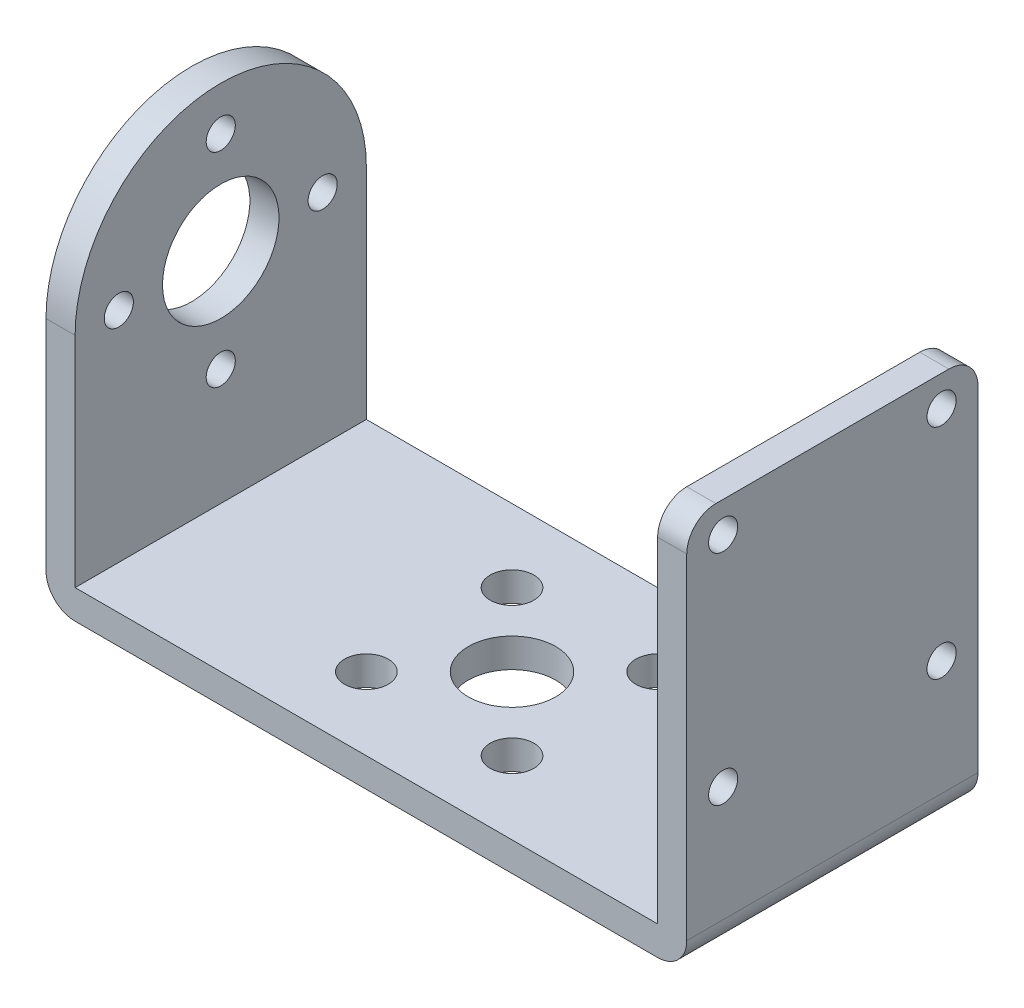
ISO-10303-21;
HEADER;
FILE_DESCRIPTION(('STEP AP214'),'2;1');
FILE_NAME('part.step','',(''),(''),'','','');
FILE_SCHEMA(('AUTOMOTIVE_DESIGN { 1 0 10303 214 1 1 1 1 }'));
ENDSEC;
DATA;
#1=APPLICATION_CONTEXT('core data for automotive mechanical design processes');
#2=APPLICATION_PROTOCOL_DEFINITION('international standard','automotive_design',2000,#1);
#3=PRODUCT_CONTEXT('',#1,'mechanical');
#4=PRODUCT('Part','Part','',(#3));
#5=PRODUCT_RELATED_PRODUCT_CATEGORY('part','',(#4));
#6=PRODUCT_DEFINITION_FORMATION('','',#4);
#7=PRODUCT_DEFINITION_CONTEXT('part definition',#1,'design');
#8=PRODUCT_DEFINITION('design','',#6,#7);
#9=PRODUCT_DEFINITION_SHAPE('','',#8);
#10=(LENGTH_UNIT() NAMED_UNIT(*) SI_UNIT(.MILLI.,.METRE.));
#11=(NAMED_UNIT(*) PLANE_ANGLE_UNIT() SI_UNIT($,.RADIAN.));
#12=(NAMED_UNIT(*) SI_UNIT($,.STERADIAN.) SOLID_ANGLE_UNIT());
#13=UNCERTAINTY_MEASURE_WITH_UNIT(LENGTH_MEASURE(1.E-05),#10,'distance_accuracy_value','');
#14=(GEOMETRIC_REPRESENTATION_CONTEXT(3) GLOBAL_UNCERTAINTY_ASSIGNED_CONTEXT((#13)) GLOBAL_UNIT_ASSIGNED_CONTEXT((#10,
#11,#12)) REPRESENTATION_CONTEXT('',''));
#15=CARTESIAN_POINT('',(0.,0.,0.));
#16=DIRECTION('',(0.,0.,1.));
#17=DIRECTION('',(1.,0.,0.));
#18=AXIS2_PLACEMENT_3D('',#15,#16,#17);
#19=CARTESIAN_POINT('',(21.,27.,0.));
#20=DIRECTION('',(0.,1.,0.));
#21=DIRECTION('',(0.,0.,1.));
#22=AXIS2_PLACEMENT_3D('',#19,#20,#21);
#23=PLANE('',#22);
#24=DIRECTION('',(0.,0.,-1.));
#25=VECTOR('',#24,1.);
#26=CARTESIAN_POINT('',(22.,27.,-10.));
#27=LINE('',#26,#25);
#28=CARTESIAN_POINT('',(22.,27.,-8.));
#29=VERTEX_POINT('',#28);
#30=CARTESIAN_POINT('',(22.,27.,8.));
#31=VERTEX_POINT('',#30);
#32=EDGE_CURVE('E100',#29,#31,#27,.F.);
#33=ORIENTED_EDGE('',*,*,#32,.F.);
#34=DIRECTION('',(1.,0.,0.));
#35=VECTOR('',#34,1.);
#36=CARTESIAN_POINT('',(-79.3584,27.,-8.));
#37=LINE('',#36,#35);
#38=CARTESIAN_POINT('',(20.,27.,-8.));
#39=VERTEX_POINT('',#38);
#40=EDGE_CURVE('E97',#39,#29,#37,.T.);
#41=ORIENTED_EDGE('',*,*,#40,.F.);
#42=DIRECTION('',(0.,0.,-1.));
#43=VECTOR('',#42,1.);
#44=CARTESIAN_POINT('',(20.,27.,-10.));
#45=LINE('',#44,#43);
#46=CARTESIAN_POINT('',(20.,27.,8.));
#47=VERTEX_POINT('',#46);
#48=EDGE_CURVE('E99',#39,#47,#45,.F.);
#49=ORIENTED_EDGE('',*,*,#48,.T.);
#50=DIRECTION('',(1.,0.,0.));
#51=VECTOR('',#50,1.);
#52=CARTESIAN_POINT('',(-79.3584,27.,8.));
#53=LINE('',#52,#51);
#54=EDGE_CURVE('E136',#31,#47,#53,.F.);
#55=ORIENTED_EDGE('',*,*,#54,.F.);
#56=EDGE_LOOP('',(#33,#41,#49,#55));
#57=FACE_BOUND('',#56,.T.);
#58=ADVANCED_FACE('F17',(#57),#23,.T.);
#59=CARTESIAN_POINT('',(-79.3584,25.,8.));
#60=DIRECTION('',(1.,0.,0.));
#61=DIRECTION('',(0.,0.,-1.));
#62=AXIS2_PLACEMENT_3D('',#59,#60,#61);
#63=CYLINDRICAL_SURFACE('',#62,2.);
#64=DIRECTION('',(1.,0.,0.));
#65=VECTOR('',#64,1.);
#66=CARTESIAN_POINT('',(21.,25.,10.));
#67=LINE('',#66,#65);
#68=CARTESIAN_POINT('',(22.,25.,10.));
#69=VERTEX_POINT('',#68);
#70=CARTESIAN_POINT('',(20.,25.,10.));
#71=VERTEX_POINT('',#70);
#72=EDGE_CURVE('E106',#69,#71,#67,.F.);
#73=ORIENTED_EDGE('',*,*,#72,.F.);
#74=CARTESIAN_POINT('',(22.,25.,8.));
#75=DIRECTION('',(1.,0.,0.));
#76=DIRECTION('',(0.,0.,-1.));
#77=AXIS2_PLACEMENT_3D('',#74,#75,#76);
#78=CIRCLE('',#77,2.);
#79=EDGE_CURVE('E239',#31,#69,#78,.T.);
#80=ORIENTED_EDGE('',*,*,#79,.F.);
#81=ORIENTED_EDGE('',*,*,#54,.T.);
#82=CARTESIAN_POINT('',(20.,25.,8.));
#83=DIRECTION('',(1.,0.,0.));
#84=DIRECTION('',(0.,0.,-1.));
#85=AXIS2_PLACEMENT_3D('',#82,#83,#84);
#86=CIRCLE('',#85,2.);
#87=EDGE_CURVE('E113',#47,#71,#86,.T.);
#88=ORIENTED_EDGE('',*,*,#87,.T.);
#89=EDGE_LOOP('',(#73,#80,#81,#88));
#90=FACE_BOUND('',#89,.T.);
#91=ADVANCED_FACE('F399',(#90),#63,.T.);
#92=CARTESIAN_POINT('',(-79.3584,25.,-8.));
#93=DIRECTION('',(1.,0.,0.));
#94=DIRECTION('',(0.,0.,-1.));
#95=AXIS2_PLACEMENT_3D('',#92,#93,#94);
#96=CYLINDRICAL_SURFACE('',#95,2.);
#97=ORIENTED_EDGE('',*,*,#40,.T.);
#98=CARTESIAN_POINT('',(22.,25.,-8.));
#99=DIRECTION('',(1.,0.,0.));
#100=DIRECTION('',(0.,0.,-1.));
#101=AXIS2_PLACEMENT_3D('',#98,#99,#100);
#102=CIRCLE('',#101,2.);
#103=CARTESIAN_POINT('',(22.,25.,-10.));
#104=VERTEX_POINT('',#103);
#105=EDGE_CURVE('E235',#104,#29,#102,.T.);
#106=ORIENTED_EDGE('',*,*,#105,.F.);
#107=DIRECTION('',(-1.,0.,0.));
#108=VECTOR('',#107,1.);
#109=CARTESIAN_POINT('',(21.,25.,-10.));
#110=LINE('',#109,#108);
#111=CARTESIAN_POINT('',(20.,25.,-10.));
#112=VERTEX_POINT('',#111);
#113=EDGE_CURVE('E105',#112,#104,#110,.F.);
#114=ORIENTED_EDGE('',*,*,#113,.F.);
#115=CARTESIAN_POINT('',(20.,25.,-8.));
#116=DIRECTION('',(1.,0.,0.));
#117=DIRECTION('',(0.,0.,-1.));
#118=AXIS2_PLACEMENT_3D('',#115,#116,#117);
#119=CIRCLE('',#118,2.);
#120=EDGE_CURVE('E20',#112,#39,#119,.T.);
#121=ORIENTED_EDGE('',*,*,#120,.T.);
#122=EDGE_LOOP('',(#97,#106,#114,#121));
#123=FACE_BOUND('',#122,.T.);
#124=ADVANCED_FACE('F116',(#123),#96,.T.);
#125=CARTESIAN_POINT('',(22.,24.89969380216,7.50060828213));
#126=DIRECTION('',(1.,0.,0.));
#127=DIRECTION('',(0.,0.,-1.));
#128=AXIS2_PLACEMENT_3D('',#125,#126,#127);
#129=CYLINDRICAL_SURFACE('',#128,1.);
#130=CARTESIAN_POINT('',(20.,24.89969380216,7.50060828213));
#131=DIRECTION('',(1.,0.,0.));
#132=DIRECTION('',(0.,0.,-1.));
#133=AXIS2_PLACEMENT_3D('',#130,#131,#132);
#134=CIRCLE('',#133,1.);
#135=CARTESIAN_POINT('',(20.,24.89969380216,6.50060828213));
#136=VERTEX_POINT('',#135);
#137=EDGE_CURVE('E280',#136,#136,#134,.F.);
#138=ORIENTED_EDGE('',*,*,#137,.T.);
#139=EDGE_LOOP('',(#138));
#140=FACE_BOUND('',#139,.T.);
#141=CARTESIAN_POINT('',(22.,24.89969380216,7.50060828213));
#142=DIRECTION('',(1.,0.,0.));
#143=DIRECTION('',(0.,0.,-1.));
#144=AXIS2_PLACEMENT_3D('',#141,#142,#143);
#145=CIRCLE('',#144,1.);
#146=CARTESIAN_POINT('',(22.,24.89969380216,6.50060828213));
#147=VERTEX_POINT('',#146);
#148=EDGE_CURVE('E231',#147,#147,#145,.F.);
#149=ORIENTED_EDGE('',*,*,#148,.F.);
#150=EDGE_LOOP('',(#149));
#151=FACE_BOUND('',#150,.T.);
#152=ADVANCED_FACE('F406',(#140,#151),#129,.F.);
#153=CARTESIAN_POINT('',(22.,24.90030617301,-7.49939170537));
#154=DIRECTION('',(1.,0.,0.));
#155=DIRECTION('',(0.,0.,-1.));
#156=AXIS2_PLACEMENT_3D('',#153,#154,#155);
#157=CYLINDRICAL_SURFACE('',#156,1.);
#158=CARTESIAN_POINT('',(20.,24.90030617301,-7.49939170537));
#159=DIRECTION('',(1.,0.,0.));
#160=DIRECTION('',(0.,0.,-1.));
#161=AXIS2_PLACEMENT_3D('',#158,#159,#160);
#162=CIRCLE('',#161,1.);
#163=CARTESIAN_POINT('',(20.,24.90030617301,-8.49939170537));
#164=VERTEX_POINT('',#163);
#165=EDGE_CURVE('E276',#164,#164,#162,.F.);
#166=ORIENTED_EDGE('',*,*,#165,.T.);
#167=EDGE_LOOP('',(#166));
#168=FACE_BOUND('',#167,.T.);
#169=CARTESIAN_POINT('',(22.,24.90030617301,-7.49939170537));
#170=DIRECTION('',(1.,0.,0.));
#171=DIRECTION('',(0.,0.,-1.));
#172=AXIS2_PLACEMENT_3D('',#169,#170,#171);
#173=CIRCLE('',#172,1.);
#174=CARTESIAN_POINT('',(22.,24.90030617301,-8.49939170537));
#175=VERTEX_POINT('',#174);
#176=EDGE_CURVE('E227',#175,#175,#173,.F.);
#177=ORIENTED_EDGE('',*,*,#176,.F.);
#178=EDGE_LOOP('',(#177));
#179=FACE_BOUND('',#178,.T.);
#180=ADVANCED_FACE('F489',(#168,#179),#157,.F.);
#181=CARTESIAN_POINT('',(22.,9.90030618551,-7.500004076222));
#182=DIRECTION('',(1.,0.,0.));
#183=DIRECTION('',(0.,0.,-1.));
#184=AXIS2_PLACEMENT_3D('',#181,#182,#183);
#185=CYLINDRICAL_SURFACE('',#184,1.);
#186=CARTESIAN_POINT('',(20.,9.90030618551,-7.500004076222));
#187=DIRECTION('',(1.,0.,0.));
#188=DIRECTION('',(0.,0.,-1.));
#189=AXIS2_PLACEMENT_3D('',#186,#187,#188);
#190=CIRCLE('',#189,1.);
#191=CARTESIAN_POINT('',(20.,9.90030618551,-8.500004076222));
#192=VERTEX_POINT('',#191);
#193=EDGE_CURVE('E272',#192,#192,#190,.F.);
#194=ORIENTED_EDGE('',*,*,#193,.T.);
#195=EDGE_LOOP('',(#194));
#196=FACE_BOUND('',#195,.T.);
#197=CARTESIAN_POINT('',(22.,9.90030618551,-7.500004076222));
#198=DIRECTION('',(1.,0.,0.));
#199=DIRECTION('',(0.,0.,-1.));
#200=AXIS2_PLACEMENT_3D('',#197,#198,#199);
#201=CIRCLE('',#200,1.);
#202=CARTESIAN_POINT('',(22.,9.90030618551,-8.500004076222));
#203=VERTEX_POINT('',#202);
#204=EDGE_CURVE('E223',#203,#203,#201,.F.);
#205=ORIENTED_EDGE('',*,*,#204,.F.);
#206=EDGE_LOOP('',(#205));
#207=FACE_BOUND('',#206,.T.);
#208=ADVANCED_FACE('F485',(#196,#207),#185,.F.);
#209=CARTESIAN_POINT('',(22.,9.899693814657,7.499995911278));
#210=DIRECTION('',(1.,0.,0.));
#211=DIRECTION('',(0.,0.,-1.));
#212=AXIS2_PLACEMENT_3D('',#209,#210,#211);
#213=CYLINDRICAL_SURFACE('',#212,1.);
#214=CARTESIAN_POINT('',(20.,9.899693814657,7.499995911278));
#215=DIRECTION('',(1.,0.,0.));
#216=DIRECTION('',(0.,0.,-1.));
#217=AXIS2_PLACEMENT_3D('',#214,#215,#216);
#218=CIRCLE('',#217,1.);
#219=CARTESIAN_POINT('',(20.,9.899693814657,6.499995911278));
#220=VERTEX_POINT('',#219);
#221=EDGE_CURVE('E268',#220,#220,#218,.F.);
#222=ORIENTED_EDGE('',*,*,#221,.T.);
#223=EDGE_LOOP('',(#222));
#224=FACE_BOUND('',#223,.T.);
#225=CARTESIAN_POINT('',(22.,9.899693814657,7.499995911278));
#226=DIRECTION('',(1.,0.,0.));
#227=DIRECTION('',(0.,0.,-1.));
#228=AXIS2_PLACEMENT_3D('',#225,#226,#227);
#229=CIRCLE('',#228,1.);
#230=CARTESIAN_POINT('',(22.,9.899693814657,6.499995911278));
#231=VERTEX_POINT('',#230);
#232=EDGE_CURVE('E218',#231,#231,#229,.F.);
#233=ORIENTED_EDGE('',*,*,#232,.F.);
#234=EDGE_LOOP('',(#233));
#235=FACE_BOUND('',#234,.T.);
#236=ADVANCED_FACE('F482',(#224,#235),#213,.F.);
#237=CARTESIAN_POINT('',(77.06874405191,17.,0.));
#238=DIRECTION('',(-1.,0.,0.));
#239=DIRECTION('',(0.,0.,1.));
#240=AXIS2_PLACEMENT_3D('',#237,#238,#239);
#241=CYLINDRICAL_SURFACE('',#240,10.);
#242=DIRECTION('',(-1.,0.,0.));
#243=VECTOR('',#242,1.);
#244=CARTESIAN_POINT('',(77.06874405191,17.,10.));
#245=LINE('',#244,#243);
#246=CARTESIAN_POINT('',(-22.,17.,10.));
#247=VERTEX_POINT('',#246);
#248=CARTESIAN_POINT('',(-20.,17.,10.));
#249=VERTEX_POINT('',#248);
#250=EDGE_CURVE('E119',#247,#249,#245,.F.);
#251=ORIENTED_EDGE('',*,*,#250,.T.);
#252=CARTESIAN_POINT('',(-20.,17.,0.));
#253=DIRECTION('',(-1.,0.,0.));
#254=DIRECTION('',(0.,0.,1.));
#255=AXIS2_PLACEMENT_3D('',#252,#253,#254);
#256=CIRCLE('',#255,10.);
#257=CARTESIAN_POINT('',(-20.,17.,-10.));
#258=VERTEX_POINT('',#257);
#259=EDGE_CURVE('E264',#249,#258,#256,.T.);
#260=ORIENTED_EDGE('',*,*,#259,.T.);
#261=DIRECTION('',(-1.,0.,0.));
#262=VECTOR('',#261,1.);
#263=CARTESIAN_POINT('',(77.06874405191,17.,-10.));
#264=LINE('',#263,#262);
#265=CARTESIAN_POINT('',(-22.,17.,-10.));
#266=VERTEX_POINT('',#265);
#267=EDGE_CURVE('E123',#258,#266,#264,.T.);
#268=ORIENTED_EDGE('',*,*,#267,.T.);
#269=CARTESIAN_POINT('',(-22.,17.,0.));
#270=DIRECTION('',(-1.,0.,0.));
#271=DIRECTION('',(0.,0.,1.));
#272=AXIS2_PLACEMENT_3D('',#269,#270,#271);
#273=CIRCLE('',#272,10.);
#274=EDGE_CURVE('E213',#247,#266,#273,.T.);
#275=ORIENTED_EDGE('',*,*,#274,.F.);
#276=EDGE_LOOP('',(#251,#260,#268,#275));
#277=FACE_BOUND('',#276,.T.);
#278=ADVANCED_FACE('F478',(#277),#241,.T.);
#279=CARTESIAN_POINT('',(-21.,17.,0.));
#280=DIRECTION('',(-1.,0.,0.));
#281=DIRECTION('',(0.,0.,1.));
#282=AXIS2_PLACEMENT_3D('',#279,#280,#281);
#283=CYLINDRICAL_SURFACE('',#282,4.);
#284=CARTESIAN_POINT('',(-20.,17.,0.));
#285=DIRECTION('',(-1.,0.,0.));
#286=DIRECTION('',(0.,0.,1.));
#287=AXIS2_PLACEMENT_3D('',#284,#285,#286);
#288=CIRCLE('',#287,4.);
#289=CARTESIAN_POINT('',(-20.,17.,4.));
#290=VERTEX_POINT('',#289);
#291=EDGE_CURVE('E243',#290,#290,#288,.F.);
#292=ORIENTED_EDGE('',*,*,#291,.T.);
#293=EDGE_LOOP('',(#292));
#294=FACE_BOUND('',#293,.T.);
#295=CARTESIAN_POINT('',(-22.,17.,0.));
#296=DIRECTION('',(-1.,0.,0.));
#297=DIRECTION('',(0.,0.,1.));
#298=AXIS2_PLACEMENT_3D('',#295,#296,#297);
#299=CIRCLE('',#298,4.);
#300=CARTESIAN_POINT('',(-22.,17.,4.));
#301=VERTEX_POINT('',#300);
#302=EDGE_CURVE('E209',#301,#301,#299,.F.);
#303=ORIENTED_EDGE('',*,*,#302,.F.);
#304=EDGE_LOOP('',(#303));
#305=FACE_BOUND('',#304,.T.);
#306=ADVANCED_FACE('F474',(#294,#305),#283,.F.);
#307=CARTESIAN_POINT('',(-21.,17.,7.));
#308=DIRECTION('',(-1.,0.,0.));
#309=DIRECTION('',(0.,0.,1.));
#310=AXIS2_PLACEMENT_3D('',#307,#308,#309);
#311=CYLINDRICAL_SURFACE('',#310,1.);
#312=CARTESIAN_POINT('',(-20.,17.,7.));
#313=DIRECTION('',(-1.,0.,0.));
#314=DIRECTION('',(0.,0.,1.));
#315=AXIS2_PLACEMENT_3D('',#312,#313,#314);
#316=CIRCLE('',#315,1.);
#317=CARTESIAN_POINT('',(-20.,17.,8.));
#318=VERTEX_POINT('',#317);
#319=EDGE_CURVE('E247',#318,#318,#316,.F.);
#320=ORIENTED_EDGE('',*,*,#319,.T.);
#321=EDGE_LOOP('',(#320));
#322=FACE_BOUND('',#321,.T.);
#323=CARTESIAN_POINT('',(-22.,17.,7.));
#324=DIRECTION('',(-1.,0.,0.));
#325=DIRECTION('',(0.,0.,1.));
#326=AXIS2_PLACEMENT_3D('',#323,#324,#325);
#327=CIRCLE('',#326,1.);
#328=CARTESIAN_POINT('',(-22.,17.,8.));
#329=VERTEX_POINT('',#328);
#330=EDGE_CURVE('E205',#329,#329,#327,.F.);
#331=ORIENTED_EDGE('',*,*,#330,.F.);
#332=EDGE_LOOP('',(#331));
#333=FACE_BOUND('',#332,.T.);
#334=ADVANCED_FACE('F470',(#322,#333),#311,.F.);
#335=CARTESIAN_POINT('',(-21.,17.,-7.));
#336=DIRECTION('',(-1.,0.,0.));
#337=DIRECTION('',(0.,0.,1.));
#338=AXIS2_PLACEMENT_3D('',#335,#336,#337);
#339=CYLINDRICAL_SURFACE('',#338,1.);
#340=CARTESIAN_POINT('',(-20.,17.,-7.));
#341=DIRECTION('',(-1.,0.,0.));
#342=DIRECTION('',(0.,0.,1.));
#343=AXIS2_PLACEMENT_3D('',#340,#341,#342);
#344=CIRCLE('',#343,1.);
#345=CARTESIAN_POINT('',(-20.,17.,-6.));
#346=VERTEX_POINT('',#345);
#347=EDGE_CURVE('E251',#346,#346,#344,.F.);
#348=ORIENTED_EDGE('',*,*,#347,.T.);
#349=EDGE_LOOP('',(#348));
#350=FACE_BOUND('',#349,.T.);
#351=CARTESIAN_POINT('',(-22.,17.,-7.));
#352=DIRECTION('',(-1.,0.,0.));
#353=DIRECTION('',(0.,0.,1.));
#354=AXIS2_PLACEMENT_3D('',#351,#352,#353);
#355=CIRCLE('',#354,1.);
#356=CARTESIAN_POINT('',(-22.,17.,-6.));
#357=VERTEX_POINT('',#356);
#358=EDGE_CURVE('E201',#357,#357,#355,.F.);
#359=ORIENTED_EDGE('',*,*,#358,.F.);
#360=EDGE_LOOP('',(#359));
#361=FACE_BOUND('',#360,.T.);
#362=ADVANCED_FACE('F466',(#350,#361),#339,.F.);
#363=CARTESIAN_POINT('',(-21.,24.,0.));
#364=DIRECTION('',(-1.,0.,0.));
#365=DIRECTION('',(0.,0.,1.));
#366=AXIS2_PLACEMENT_3D('',#363,#364,#365);
#367=CYLINDRICAL_SURFACE('',#366,1.);
#368=CARTESIAN_POINT('',(-20.,24.,0.));
#369=DIRECTION('',(-1.,0.,0.));
#370=DIRECTION('',(0.,0.,1.));
#371=AXIS2_PLACEMENT_3D('',#368,#369,#370);
#372=CIRCLE('',#371,1.);
#373=CARTESIAN_POINT('',(-20.,24.,1.));
#374=VERTEX_POINT('',#373);
#375=EDGE_CURVE('E255',#374,#374,#372,.F.);
#376=ORIENTED_EDGE('',*,*,#375,.T.);
#377=EDGE_LOOP('',(#376));
#378=FACE_BOUND('',#377,.T.);
#379=CARTESIAN_POINT('',(-22.,24.,0.));
#380=DIRECTION('',(-1.,0.,0.));
#381=DIRECTION('',(0.,0.,1.));
#382=AXIS2_PLACEMENT_3D('',#379,#380,#381);
#383=CIRCLE('',#382,1.);
#384=CARTESIAN_POINT('',(-22.,24.,1.));
#385=VERTEX_POINT('',#384);
#386=EDGE_CURVE('E197',#385,#385,#383,.F.);
#387=ORIENTED_EDGE('',*,*,#386,.F.);
#388=EDGE_LOOP('',(#387));
#389=FACE_BOUND('',#388,.T.);
#390=ADVANCED_FACE('F462',(#378,#389),#367,.F.);
#391=CARTESIAN_POINT('',(-21.,10.,0.));
#392=DIRECTION('',(-1.,0.,0.));
#393=DIRECTION('',(0.,0.,1.));
#394=AXIS2_PLACEMENT_3D('',#391,#392,#393);
#395=CYLINDRICAL_SURFACE('',#394,1.);
#396=CARTESIAN_POINT('',(-20.,10.,0.));
#397=DIRECTION('',(-1.,0.,0.));
#398=DIRECTION('',(0.,0.,1.));
#399=AXIS2_PLACEMENT_3D('',#396,#397,#398);
#400=CIRCLE('',#399,1.);
#401=CARTESIAN_POINT('',(-20.,10.,1.));
#402=VERTEX_POINT('',#401);
#403=EDGE_CURVE('E259',#402,#402,#400,.F.);
#404=ORIENTED_EDGE('',*,*,#403,.T.);
#405=EDGE_LOOP('',(#404));
#406=FACE_BOUND('',#405,.T.);
#407=CARTESIAN_POINT('',(-22.,10.,0.));
#408=DIRECTION('',(-1.,0.,0.));
#409=DIRECTION('',(0.,0.,1.));
#410=AXIS2_PLACEMENT_3D('',#407,#408,#409);
#411=CIRCLE('',#410,1.);
#412=CARTESIAN_POINT('',(-22.,10.,1.));
#413=VERTEX_POINT('',#412);
#414=EDGE_CURVE('E192',#413,#413,#411,.F.);
#415=ORIENTED_EDGE('',*,*,#414,.F.);
#416=EDGE_LOOP('',(#415));
#417=FACE_BOUND('',#416,.T.);
#418=ADVANCED_FACE('F458',(#406,#417),#395,.F.);
#419=CARTESIAN_POINT('',(20.,0.,-10.));
#420=DIRECTION('',(1.,0.,0.));
#421=DIRECTION('',(0.,0.,-1.));
#422=AXIS2_PLACEMENT_3D('',#419,#420,#421);
#423=PLANE('',#422);
#424=ORIENTED_EDGE('',*,*,#221,.F.);
#425=EDGE_LOOP('',(#424));
#426=FACE_BOUND('',#425,.T.);
#427=ORIENTED_EDGE('',*,*,#193,.F.);
#428=EDGE_LOOP('',(#427));
#429=FACE_BOUND('',#428,.T.);
#430=ORIENTED_EDGE('',*,*,#165,.F.);
#431=EDGE_LOOP('',(#430));
#432=FACE_BOUND('',#431,.T.);
#433=ORIENTED_EDGE('',*,*,#137,.F.);
#434=EDGE_LOOP('',(#433));
#435=FACE_BOUND('',#434,.T.);
#436=DIRECTION('',(0.,0.,1.));
#437=VECTOR('',#436,1.);
#438=CARTESIAN_POINT('',(20.,2.,0.));
#439=LINE('',#438,#437);
#440=CARTESIAN_POINT('',(20.,2.,10.));
#441=VERTEX_POINT('',#440);
#442=CARTESIAN_POINT('',(20.,2.,-10.));
#443=VERTEX_POINT('',#442);
#444=EDGE_CURVE('E196',#441,#443,#439,.F.);
#445=ORIENTED_EDGE('',*,*,#444,.F.);
#446=DIRECTION('',(0.,1.,0.));
#447=VECTOR('',#446,1.);
#448=CARTESIAN_POINT('',(20.,0.,10.));
#449=LINE('',#448,#447);
#450=EDGE_CURVE('E285',#71,#441,#449,.F.);
#451=ORIENTED_EDGE('',*,*,#450,.F.);
#452=ORIENTED_EDGE('',*,*,#87,.F.);
#453=ORIENTED_EDGE('',*,*,#48,.F.);
#454=ORIENTED_EDGE('',*,*,#120,.F.);
#455=DIRECTION('',(0.,1.,0.));
#456=VECTOR('',#455,1.);
#457=CARTESIAN_POINT('',(20.,0.,-10.));
#458=LINE('',#457,#456);
#459=EDGE_CURVE('E283',#443,#112,#458,.T.);
#460=ORIENTED_EDGE('',*,*,#459,.F.);
#461=EDGE_LOOP('',(#445,#451,#452,#453,#454,#460));
#462=FACE_BOUND('',#461,.T.);
#463=ADVANCED_FACE('F110',(#426,#429,#432,#435,#462),#423,.F.);
#464=CARTESIAN_POINT('',(-20.,0.,10.));
#465=DIRECTION('',(-1.,0.,0.));
#466=DIRECTION('',(0.,0.,1.));
#467=AXIS2_PLACEMENT_3D('',#464,#465,#466);
#468=PLANE('',#467);
#469=ORIENTED_EDGE('',*,*,#291,.F.);
#470=EDGE_LOOP('',(#469));
#471=FACE_BOUND('',#470,.T.);
#472=ORIENTED_EDGE('',*,*,#319,.F.);
#473=EDGE_LOOP('',(#472));
#474=FACE_BOUND('',#473,.T.);
#475=ORIENTED_EDGE('',*,*,#347,.F.);
#476=EDGE_LOOP('',(#475));
#477=FACE_BOUND('',#476,.T.);
#478=ORIENTED_EDGE('',*,*,#375,.F.);
#479=EDGE_LOOP('',(#478));
#480=FACE_BOUND('',#479,.T.);
#481=ORIENTED_EDGE('',*,*,#403,.F.);
#482=EDGE_LOOP('',(#481));
#483=FACE_BOUND('',#482,.T.);
#484=ORIENTED_EDGE('',*,*,#259,.F.);
#485=DIRECTION('',(0.,1.,0.));
#486=VECTOR('',#485,1.);
#487=CARTESIAN_POINT('',(-20.,0.,10.));
#488=LINE('',#487,#486);
#489=CARTESIAN_POINT('',(-20.,2.,10.));
#490=VERTEX_POINT('',#489);
#491=EDGE_CURVE('E267',#490,#249,#488,.T.);
#492=ORIENTED_EDGE('',*,*,#491,.F.);
#493=DIRECTION('',(0.,0.,1.));
#494=VECTOR('',#493,1.);
#495=CARTESIAN_POINT('',(-20.,2.,0.));
#496=LINE('',#495,#494);
#497=CARTESIAN_POINT('',(-20.,2.,-10.));
#498=VERTEX_POINT('',#497);
#499=EDGE_CURVE('E314',#498,#490,#496,.T.);
#500=ORIENTED_EDGE('',*,*,#499,.F.);
#501=DIRECTION('',(0.,1.,0.));
#502=VECTOR('',#501,1.);
#503=CARTESIAN_POINT('',(-20.,0.,-10.));
#504=LINE('',#503,#502);
#505=EDGE_CURVE('E263',#258,#498,#504,.F.);
#506=ORIENTED_EDGE('',*,*,#505,.F.);
#507=EDGE_LOOP('',(#484,#492,#500,#506));
#508=FACE_BOUND('',#507,.T.);
#509=ADVANCED_FACE('F371',(#471,#474,#477,#480,#483,#508),#468,.F.);
#510=CARTESIAN_POINT('',(22.,0.,-10.));
#511=DIRECTION('',(1.,0.,0.));
#512=DIRECTION('',(0.,0.,-1.));
#513=AXIS2_PLACEMENT_3D('',#510,#511,#512);
#514=PLANE('',#513);
#515=ORIENTED_EDGE('',*,*,#232,.T.);
#516=EDGE_LOOP('',(#515));
#517=FACE_BOUND('',#516,.T.);
#518=ORIENTED_EDGE('',*,*,#204,.T.);
#519=EDGE_LOOP('',(#518));
#520=FACE_BOUND('',#519,.T.);
#521=ORIENTED_EDGE('',*,*,#176,.T.);
#522=EDGE_LOOP('',(#521));
#523=FACE_BOUND('',#522,.T.);
#524=ORIENTED_EDGE('',*,*,#148,.T.);
#525=EDGE_LOOP('',(#524));
#526=FACE_BOUND('',#525,.T.);
#527=DIRECTION('',(0.,1.,0.));
#528=VECTOR('',#527,1.);
#529=CARTESIAN_POINT('',(22.,0.,-10.));
#530=LINE('',#529,#528);
#531=CARTESIAN_POINT('',(22.,2.,-10.));
#532=VERTEX_POINT('',#531);
#533=EDGE_CURVE('E238',#532,#104,#530,.T.);
#534=ORIENTED_EDGE('',*,*,#533,.T.);
#535=ORIENTED_EDGE('',*,*,#105,.T.);
#536=ORIENTED_EDGE('',*,*,#32,.T.);
#537=ORIENTED_EDGE('',*,*,#79,.T.);
#538=DIRECTION('',(0.,1.,0.));
#539=VECTOR('',#538,1.);
#540=CARTESIAN_POINT('',(22.,0.,10.));
#541=LINE('',#540,#539);
#542=CARTESIAN_POINT('',(22.,2.,10.));
#543=VERTEX_POINT('',#542);
#544=EDGE_CURVE('E242',#69,#543,#541,.F.);
#545=ORIENTED_EDGE('',*,*,#544,.T.);
#546=DIRECTION('',(0.,0.,-1.));
#547=VECTOR('',#546,1.);
#548=CARTESIAN_POINT('',(22.,2.,10.));
#549=LINE('',#548,#547);
#550=EDGE_CURVE('E187',#532,#543,#549,.F.);
#551=ORIENTED_EDGE('',*,*,#550,.F.);
#552=EDGE_LOOP('',(#534,#535,#536,#537,#545,#551));
#553=FACE_BOUND('',#552,.T.);
#554=ADVANCED_FACE('F397',(#517,#520,#523,#526,#553),#514,.T.);
#555=CARTESIAN_POINT('',(-22.,0.,10.));
#556=DIRECTION('',(-1.,0.,0.));
#557=DIRECTION('',(0.,0.,1.));
#558=AXIS2_PLACEMENT_3D('',#555,#556,#557);
#559=PLANE('',#558);
#560=ORIENTED_EDGE('',*,*,#414,.T.);
#561=EDGE_LOOP('',(#560));
#562=FACE_BOUND('',#561,.T.);
#563=ORIENTED_EDGE('',*,*,#386,.T.);
#564=EDGE_LOOP('',(#563));
#565=FACE_BOUND('',#564,.T.);
#566=ORIENTED_EDGE('',*,*,#358,.T.);
#567=EDGE_LOOP('',(#566));
#568=FACE_BOUND('',#567,.T.);
#569=ORIENTED_EDGE('',*,*,#330,.T.);
#570=EDGE_LOOP('',(#569));
#571=FACE_BOUND('',#570,.T.);
#572=ORIENTED_EDGE('',*,*,#302,.T.);
#573=EDGE_LOOP('',(#572));
#574=FACE_BOUND('',#573,.T.);
#575=DIRECTION('',(0.,1.,0.));
#576=VECTOR('',#575,1.);
#577=CARTESIAN_POINT('',(-22.,0.,10.));
#578=LINE('',#577,#576);
#579=CARTESIAN_POINT('',(-22.,2.,10.));
#580=VERTEX_POINT('',#579);
#581=EDGE_CURVE('E217',#580,#247,#578,.T.);
#582=ORIENTED_EDGE('',*,*,#581,.T.);
#583=ORIENTED_EDGE('',*,*,#274,.T.);
#584=DIRECTION('',(0.,1.,0.));
#585=VECTOR('',#584,1.);
#586=CARTESIAN_POINT('',(-22.,0.,-10.));
#587=LINE('',#586,#585);
#588=CARTESIAN_POINT('',(-22.,2.,-10.));
#589=VERTEX_POINT('',#588);
#590=EDGE_CURVE('E222',#266,#589,#587,.F.);
#591=ORIENTED_EDGE('',*,*,#590,.T.);
#592=DIRECTION('',(0.,0.,1.));
#593=VECTOR('',#592,1.);
#594=CARTESIAN_POINT('',(-22.,2.,-10.));
#595=LINE('',#594,#593);
#596=EDGE_CURVE('E176',#580,#589,#595,.F.);
#597=ORIENTED_EDGE('',*,*,#596,.F.);
#598=EDGE_LOOP('',(#582,#583,#591,#597));
#599=FACE_BOUND('',#598,.T.);
#600=ADVANCED_FACE('F363',(#562,#565,#568,#571,#574,#599),#559,.T.);
#601=CARTESIAN_POINT('',(0.,2.,0.));
#602=DIRECTION('',(0.,1.,0.));
#603=DIRECTION('',(0.,0.,1.));
#604=AXIS2_PLACEMENT_3D('',#601,#602,#603);
#605=PLANE('',#604);
#606=CARTESIAN_POINT('',(-5.,2.,-5.));
#607=DIRECTION('',(0.,-1.,0.));
#608=DIRECTION('',(0.,0.,-1.));
#609=AXIS2_PLACEMENT_3D('',#606,#607,#608);
#610=CIRCLE('',#609,1.5);
#611=CARTESIAN_POINT('',(-5.,2.,-6.5));
#612=VERTEX_POINT('',#611);
#613=EDGE_CURVE('E155',#612,#612,#610,.T.);
#614=ORIENTED_EDGE('',*,*,#613,.T.);
#615=EDGE_LOOP('',(#614));
#616=FACE_BOUND('',#615,.T.);
#617=CARTESIAN_POINT('',(0.,2.,0.));
#618=DIRECTION('',(0.,-1.,0.));
#619=DIRECTION('',(0.,0.,-1.));
#620=AXIS2_PLACEMENT_3D('',#617,#618,#619);
#621=CIRCLE('',#620,3.);
#622=CARTESIAN_POINT('',(0.,2.,-3.));
#623=VERTEX_POINT('',#622);
#624=EDGE_CURVE('E160',#623,#623,#621,.T.);
#625=ORIENTED_EDGE('',*,*,#624,.T.);
#626=EDGE_LOOP('',(#625));
#627=FACE_BOUND('',#626,.T.);
#628=CARTESIAN_POINT('',(-5.,2.,5.));
#629=DIRECTION('',(0.,-1.,0.));
#630=DIRECTION('',(0.,0.,-1.));
#631=AXIS2_PLACEMENT_3D('',#628,#629,#630);
#632=CIRCLE('',#631,1.5);
#633=CARTESIAN_POINT('',(-5.,2.,3.5));
#634=VERTEX_POINT('',#633);
#635=EDGE_CURVE('E164',#634,#634,#632,.T.);
#636=ORIENTED_EDGE('',*,*,#635,.T.);
#637=EDGE_LOOP('',(#636));
#638=FACE_BOUND('',#637,.T.);
#639=CARTESIAN_POINT('',(5.,2.,5.));
#640=DIRECTION('',(0.,-1.,0.));
#641=DIRECTION('',(0.,0.,-1.));
#642=AXIS2_PLACEMENT_3D('',#639,#640,#641);
#643=CIRCLE('',#642,1.5);
#644=CARTESIAN_POINT('',(5.,2.,3.5));
#645=VERTEX_POINT('',#644);
#646=EDGE_CURVE('E168',#645,#645,#643,.T.);
#647=ORIENTED_EDGE('',*,*,#646,.T.);
#648=EDGE_LOOP('',(#647));
#649=FACE_BOUND('',#648,.T.);
#650=CARTESIAN_POINT('',(5.,2.,-5.));
#651=DIRECTION('',(0.,-1.,0.));
#652=DIRECTION('',(0.,0.,-1.));
#653=AXIS2_PLACEMENT_3D('',#650,#651,#652);
#654=CIRCLE('',#653,1.5);
#655=CARTESIAN_POINT('',(5.,2.,-6.5));
#656=VERTEX_POINT('',#655);
#657=EDGE_CURVE('E172',#656,#656,#654,.T.);
#658=ORIENTED_EDGE('',*,*,#657,.T.);
#659=EDGE_LOOP('',(#658));
#660=FACE_BOUND('',#659,.T.);
#661=DIRECTION('',(1.,0.,0.));
#662=VECTOR('',#661,1.);
#663=CARTESIAN_POINT('',(0.,2.,-10.));
#664=LINE('',#663,#662);
#665=EDGE_CURVE('E183',#443,#498,#664,.F.);
#666=ORIENTED_EDGE('',*,*,#665,.T.);
#667=ORIENTED_EDGE('',*,*,#499,.T.);
#668=DIRECTION('',(-1.,0.,0.));
#669=VECTOR('',#668,1.);
#670=CARTESIAN_POINT('',(0.,2.,10.));
#671=LINE('',#670,#669);
#672=EDGE_CURVE('E191',#490,#441,#671,.F.);
#673=ORIENTED_EDGE('',*,*,#672,.T.);
#674=ORIENTED_EDGE('',*,*,#444,.T.);
#675=EDGE_LOOP('',(#666,#667,#673,#674));
#676=FACE_BOUND('',#675,.T.);
#677=ADVANCED_FACE('F376',(#616,#627,#638,#649,#660,#676),#605,.T.);
#678=CARTESIAN_POINT('',(0.,1.,10.));
#679=DIRECTION('',(0.,0.,-1.));
#680=DIRECTION('',(-1.,0.,0.));
#681=AXIS2_PLACEMENT_3D('',#678,#679,#680);
#682=PLANE('',#681);
#683=ORIENTED_EDGE('',*,*,#672,.F.);
#684=ORIENTED_EDGE('',*,*,#491,.T.);
#685=ORIENTED_EDGE('',*,*,#250,.F.);
#686=ORIENTED_EDGE('',*,*,#581,.F.);
#687=CARTESIAN_POINT('',(-20.,2.,10.));
#688=DIRECTION('',(0.,0.,1.));
#689=DIRECTION('',(1.,0.,0.));
#690=AXIS2_PLACEMENT_3D('',#687,#688,#689);
#691=CIRCLE('',#690,2.);
#692=CARTESIAN_POINT('',(-20.,0.,10.));
#693=VERTEX_POINT('',#692);
#694=EDGE_CURVE('E177',#693,#580,#691,.F.);
#695=ORIENTED_EDGE('',*,*,#694,.F.);
#696=DIRECTION('',(1.,0.,0.));
#697=VECTOR('',#696,1.);
#698=CARTESIAN_POINT('',(0.,0.,10.));
#699=LINE('',#698,#697);
#700=CARTESIAN_POINT('',(20.,0.,10.));
#701=VERTEX_POINT('',#700);
#702=EDGE_CURVE('E159',#693,#701,#699,.T.);
#703=ORIENTED_EDGE('',*,*,#702,.T.);
#704=CARTESIAN_POINT('',(20.,2.,10.));
#705=DIRECTION('',(0.,0.,-1.));
#706=DIRECTION('',(-1.,0.,0.));
#707=AXIS2_PLACEMENT_3D('',#704,#705,#706);
#708=CIRCLE('',#707,2.);
#709=EDGE_CURVE('E188',#543,#701,#708,.T.);
#710=ORIENTED_EDGE('',*,*,#709,.F.);
#711=ORIENTED_EDGE('',*,*,#544,.F.);
#712=ORIENTED_EDGE('',*,*,#72,.T.);
#713=ORIENTED_EDGE('',*,*,#450,.T.);
#714=EDGE_LOOP('',(#683,#684,#685,#686,#695,#703,#710,#711,#712,#713));
#715=FACE_BOUND('',#714,.T.);
#716=ADVANCED_FACE('F367',(#715),#682,.F.);
#717=CARTESIAN_POINT('',(20.,2.,10.));
#718=DIRECTION('',(0.,0.,-1.));
#719=DIRECTION('',(-1.,0.,0.));
#720=AXIS2_PLACEMENT_3D('',#717,#718,#719);
#721=CYLINDRICAL_SURFACE('',#720,2.);
#722=CARTESIAN_POINT('',(20.,2.,-10.));
#723=DIRECTION('',(0.,0.,-1.));
#724=DIRECTION('',(-1.,0.,0.));
#725=AXIS2_PLACEMENT_3D('',#722,#723,#724);
#726=CIRCLE('',#725,2.);
#727=CARTESIAN_POINT('',(20.,0.,-10.));
#728=VERTEX_POINT('',#727);
#729=EDGE_CURVE('E184',#728,#532,#726,.F.);
#730=ORIENTED_EDGE('',*,*,#729,.T.);
#731=ORIENTED_EDGE('',*,*,#550,.T.);
#732=ORIENTED_EDGE('',*,*,#709,.T.);
#733=DIRECTION('',(0.,0.,1.));
#734=VECTOR('',#733,1.);
#735=CARTESIAN_POINT('',(20.,0.,0.));
#736=LINE('',#735,#734);
#737=EDGE_CURVE('E325',#701,#728,#736,.F.);
#738=ORIENTED_EDGE('',*,*,#737,.T.);
#739=EDGE_LOOP('',(#730,#731,#732,#738));
#740=FACE_BOUND('',#739,.T.);
#741=ADVANCED_FACE('F392',(#740),#721,.T.);
#742=CARTESIAN_POINT('',(0.,1.,-10.));
#743=DIRECTION('',(0.,0.,1.));
#744=DIRECTION('',(1.,0.,0.));
#745=AXIS2_PLACEMENT_3D('',#742,#743,#744);
#746=PLANE('',#745);
#747=ORIENTED_EDGE('',*,*,#665,.F.);
#748=ORIENTED_EDGE('',*,*,#459,.T.);
#749=ORIENTED_EDGE('',*,*,#113,.T.);
#750=ORIENTED_EDGE('',*,*,#533,.F.);
#751=ORIENTED_EDGE('',*,*,#729,.F.);
#752=DIRECTION('',(1.,0.,0.));
#753=VECTOR('',#752,1.);
#754=CARTESIAN_POINT('',(0.,0.,-10.));
#755=LINE('',#754,#753);
#756=CARTESIAN_POINT('',(-20.,0.,-10.));
#757=VERTEX_POINT('',#756);
#758=EDGE_CURVE('E329',#728,#757,#755,.F.);
#759=ORIENTED_EDGE('',*,*,#758,.T.);
#760=CARTESIAN_POINT('',(-20.,2.,-10.));
#761=DIRECTION('',(0.,0.,1.));
#762=DIRECTION('',(1.,0.,0.));
#763=AXIS2_PLACEMENT_3D('',#760,#761,#762);
#764=CIRCLE('',#763,2.);
#765=EDGE_CURVE('E36',#589,#757,#764,.T.);
#766=ORIENTED_EDGE('',*,*,#765,.F.);
#767=ORIENTED_EDGE('',*,*,#590,.F.);
#768=ORIENTED_EDGE('',*,*,#267,.F.);
#769=ORIENTED_EDGE('',*,*,#505,.T.);
#770=EDGE_LOOP('',(#747,#748,#749,#750,#751,#759,#766,#767,#768,#769));
#771=FACE_BOUND('',#770,.T.);
#772=ADVANCED_FACE('F380',(#771),#746,.F.);
#773=CARTESIAN_POINT('',(-20.,2.,-10.));
#774=DIRECTION('',(0.,0.,1.));
#775=DIRECTION('',(1.,0.,0.));
#776=AXIS2_PLACEMENT_3D('',#773,#774,#775);
#777=CYLINDRICAL_SURFACE('',#776,2.);
#778=ORIENTED_EDGE('',*,*,#694,.T.);
#779=ORIENTED_EDGE('',*,*,#596,.T.);
#780=ORIENTED_EDGE('',*,*,#765,.T.);
#781=DIRECTION('',(0.,0.,1.));
#782=VECTOR('',#781,1.);
#783=CARTESIAN_POINT('',(-20.,0.,0.));
#784=LINE('',#783,#782);
#785=EDGE_CURVE('E154',#757,#693,#784,.T.);
#786=ORIENTED_EDGE('',*,*,#785,.T.);
#787=EDGE_LOOP('',(#778,#779,#780,#786));
#788=FACE_BOUND('',#787,.T.);
#789=ADVANCED_FACE('F385',(#788),#777,.T.);
#790=CARTESIAN_POINT('',(5.,1.,-5.));
#791=DIRECTION('',(0.,-1.,0.));
#792=DIRECTION('',(0.,0.,-1.));
#793=AXIS2_PLACEMENT_3D('',#790,#791,#792);
#794=CYLINDRICAL_SURFACE('',#793,1.5);
#795=ORIENTED_EDGE('',*,*,#657,.F.);
#796=EDGE_LOOP('',(#795));
#797=FACE_BOUND('',#796,.T.);
#798=CARTESIAN_POINT('',(5.,0.,-5.));
#799=DIRECTION('',(0.,-1.,0.));
#800=DIRECTION('',(0.,0.,-1.));
#801=AXIS2_PLACEMENT_3D('',#798,#799,#800);
#802=CIRCLE('',#801,1.5);
#803=CARTESIAN_POINT('',(5.,0.,-6.5));
#804=VERTEX_POINT('',#803);
#805=EDGE_CURVE('E150',#804,#804,#802,.T.);
#806=ORIENTED_EDGE('',*,*,#805,.T.);
#807=EDGE_LOOP('',(#806));
#808=FACE_BOUND('',#807,.T.);
#809=ADVANCED_FACE('F431',(#797,#808),#794,.F.);
#810=CARTESIAN_POINT('',(5.,1.,5.));
#811=DIRECTION('',(0.,-1.,0.));
#812=DIRECTION('',(0.,0.,-1.));
#813=AXIS2_PLACEMENT_3D('',#810,#811,#812);
#814=CYLINDRICAL_SURFACE('',#813,1.5);
#815=ORIENTED_EDGE('',*,*,#646,.F.);
#816=EDGE_LOOP('',(#815));
#817=FACE_BOUND('',#816,.T.);
#818=CARTESIAN_POINT('',(5.,0.,5.));
#819=DIRECTION('',(0.,-1.,0.));
#820=DIRECTION('',(0.,0.,-1.));
#821=AXIS2_PLACEMENT_3D('',#818,#819,#820);
#822=CIRCLE('',#821,1.5);
#823=CARTESIAN_POINT('',(5.,0.,3.5));
#824=VERTEX_POINT('',#823);
#825=EDGE_CURVE('E146',#824,#824,#822,.T.);
#826=ORIENTED_EDGE('',*,*,#825,.T.);
#827=EDGE_LOOP('',(#826));
#828=FACE_BOUND('',#827,.T.);
#829=ADVANCED_FACE('F427',(#817,#828),#814,.F.);
#830=CARTESIAN_POINT('',(-5.,1.,5.));
#831=DIRECTION('',(0.,-1.,0.));
#832=DIRECTION('',(0.,0.,-1.));
#833=AXIS2_PLACEMENT_3D('',#830,#831,#832);
#834=CYLINDRICAL_SURFACE('',#833,1.5);
#835=ORIENTED_EDGE('',*,*,#635,.F.);
#836=EDGE_LOOP('',(#835));
#837=FACE_BOUND('',#836,.T.);
#838=CARTESIAN_POINT('',(-5.,0.,5.));
#839=DIRECTION('',(0.,-1.,0.));
#840=DIRECTION('',(0.,0.,-1.));
#841=AXIS2_PLACEMENT_3D('',#838,#839,#840);
#842=CIRCLE('',#841,1.5);
#843=CARTESIAN_POINT('',(-5.,0.,3.5));
#844=VERTEX_POINT('',#843);
#845=EDGE_CURVE('E142',#844,#844,#842,.T.);
#846=ORIENTED_EDGE('',*,*,#845,.T.);
#847=EDGE_LOOP('',(#846));
#848=FACE_BOUND('',#847,.T.);
#849=ADVANCED_FACE('F423',(#837,#848),#834,.F.);
#850=CARTESIAN_POINT('',(0.,1.,0.));
#851=DIRECTION('',(0.,-1.,0.));
#852=DIRECTION('',(0.,0.,-1.));
#853=AXIS2_PLACEMENT_3D('',#850,#851,#852);
#854=CYLINDRICAL_SURFACE('',#853,3.);
#855=ORIENTED_EDGE('',*,*,#624,.F.);
#856=EDGE_LOOP('',(#855));
#857=FACE_BOUND('',#856,.T.);
#858=CARTESIAN_POINT('',(0.,0.,0.));
#859=DIRECTION('',(0.,-1.,0.));
#860=DIRECTION('',(0.,0.,-1.));
#861=AXIS2_PLACEMENT_3D('',#858,#859,#860);
#862=CIRCLE('',#861,3.);
#863=CARTESIAN_POINT('',(0.,0.,-3.));
#864=VERTEX_POINT('',#863);
#865=EDGE_CURVE('E27',#864,#864,#862,.T.);
#866=ORIENTED_EDGE('',*,*,#865,.T.);
#867=EDGE_LOOP('',(#866));
#868=FACE_BOUND('',#867,.T.);
#869=ADVANCED_FACE('F415',(#857,#868),#854,.F.);
#870=CARTESIAN_POINT('',(-5.,1.,-5.));
#871=DIRECTION('',(0.,-1.,0.));
#872=DIRECTION('',(0.,0.,-1.));
#873=AXIS2_PLACEMENT_3D('',#870,#871,#872);
#874=CYLINDRICAL_SURFACE('',#873,1.5);
#875=ORIENTED_EDGE('',*,*,#613,.F.);
#876=EDGE_LOOP('',(#875));
#877=FACE_BOUND('',#876,.T.);
#878=CARTESIAN_POINT('',(-5.,0.,-5.));
#879=DIRECTION('',(0.,-1.,0.));
#880=DIRECTION('',(0.,0.,-1.));
#881=AXIS2_PLACEMENT_3D('',#878,#879,#880);
#882=CIRCLE('',#881,1.5);
#883=CARTESIAN_POINT('',(-5.,0.,-6.5));
#884=VERTEX_POINT('',#883);
#885=EDGE_CURVE('E11',#884,#884,#882,.T.);
#886=ORIENTED_EDGE('',*,*,#885,.T.);
#887=EDGE_LOOP('',(#886));
#888=FACE_BOUND('',#887,.T.);
#889=ADVANCED_FACE('F409',(#877,#888),#874,.F.);
#890=CARTESIAN_POINT('',(0.,0.,0.));
#891=DIRECTION('',(0.,1.,0.));
#892=DIRECTION('',(0.,0.,1.));
#893=AXIS2_PLACEMENT_3D('',#890,#891,#892);
#894=PLANE('',#893);
#895=ORIENTED_EDGE('',*,*,#885,.F.);
#896=EDGE_LOOP('',(#895));
#897=FACE_BOUND('',#896,.T.);
#898=ORIENTED_EDGE('',*,*,#865,.F.);
#899=EDGE_LOOP('',(#898));
#900=FACE_BOUND('',#899,.T.);
#901=ORIENTED_EDGE('',*,*,#845,.F.);
#902=EDGE_LOOP('',(#901));
#903=FACE_BOUND('',#902,.T.);
#904=ORIENTED_EDGE('',*,*,#825,.F.);
#905=EDGE_LOOP('',(#904));
#906=FACE_BOUND('',#905,.T.);
#907=ORIENTED_EDGE('',*,*,#805,.F.);
#908=EDGE_LOOP('',(#907));
#909=FACE_BOUND('',#908,.T.);
#910=ORIENTED_EDGE('',*,*,#758,.F.);
#911=ORIENTED_EDGE('',*,*,#737,.F.);
#912=ORIENTED_EDGE('',*,*,#702,.F.);
#913=ORIENTED_EDGE('',*,*,#785,.F.);
#914=EDGE_LOOP('',(#910,#911,#912,#913));
#915=FACE_BOUND('',#914,.T.);
#916=ADVANCED_FACE('F390',(#897,#900,#903,#906,#909,#915),#894,.F.);
#917=CLOSED_SHELL('',(#58,#91,#124,#152,#180,#208,#236,#278,#306,#334,#362,#390,#418,#463,#509,
#554,#600,#677,#716,#741,#772,#789,#809,#829,#849,#869,#889,#916));
#918=MANIFOLD_SOLID_BREP('B1',#917);
#919=ADVANCED_BREP_SHAPE_REPRESENTATION('',(#18,#918),#14);
#920=SHAPE_DEFINITION_REPRESENTATION(#9,#919);
ENDSEC;
END-ISO-10303-21;
